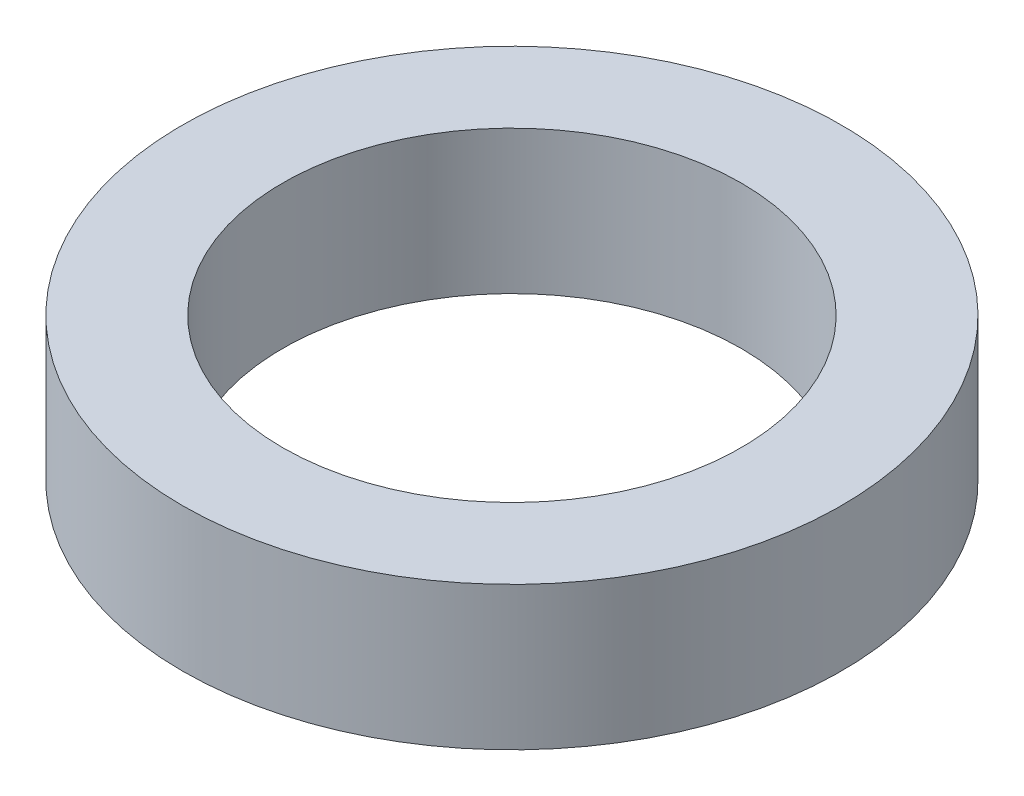
ISO-10303-21;
HEADER;
FILE_DESCRIPTION(('STEP AP214'),'2;1');
FILE_NAME('part.step','',(''),(''),'','','');
FILE_SCHEMA(('AUTOMOTIVE_DESIGN { 1 0 10303 214 1 1 1 1 }'));
ENDSEC;
DATA;
#1=APPLICATION_CONTEXT('core data for automotive mechanical design processes');
#2=APPLICATION_PROTOCOL_DEFINITION('international standard','automotive_design',2000,#1);
#3=PRODUCT_CONTEXT('',#1,'mechanical');
#4=PRODUCT('Part','Part','',(#3));
#5=PRODUCT_RELATED_PRODUCT_CATEGORY('part','',(#4));
#6=PRODUCT_DEFINITION_FORMATION('','',#4);
#7=PRODUCT_DEFINITION_CONTEXT('part definition',#1,'design');
#8=PRODUCT_DEFINITION('design','',#6,#7);
#9=PRODUCT_DEFINITION_SHAPE('','',#8);
#10=(LENGTH_UNIT() NAMED_UNIT(*) SI_UNIT(.MILLI.,.METRE.));
#11=(NAMED_UNIT(*) PLANE_ANGLE_UNIT() SI_UNIT($,.RADIAN.));
#12=(NAMED_UNIT(*) SI_UNIT($,.STERADIAN.) SOLID_ANGLE_UNIT());
#13=UNCERTAINTY_MEASURE_WITH_UNIT(LENGTH_MEASURE(1.E-05),#10,'distance_accuracy_value','');
#14=(GEOMETRIC_REPRESENTATION_CONTEXT(3) GLOBAL_UNCERTAINTY_ASSIGNED_CONTEXT((#13)) GLOBAL_UNIT_ASSIGNED_CONTEXT((#10,
#11,#12)) REPRESENTATION_CONTEXT('',''));
#15=CARTESIAN_POINT('',(0.,0.,0.));
#16=DIRECTION('',(0.,0.,1.));
#17=DIRECTION('',(1.,0.,0.));
#18=AXIS2_PLACEMENT_3D('',#15,#16,#17);
#19=CARTESIAN_POINT('',(0.,25.,0.));
#20=DIRECTION('',(0.,-1.,0.));
#21=DIRECTION('',(0.,0.,-1.));
#22=AXIS2_PLACEMENT_3D('',#19,#20,#21);
#23=CYLINDRICAL_SURFACE('',#22,57.5);
#24=CARTESIAN_POINT('',(0.,25.,0.));
#25=DIRECTION('',(0.,1.,0.));
#26=DIRECTION('',(0.,0.,1.));
#27=AXIS2_PLACEMENT_3D('',#24,#25,#26);
#28=CIRCLE('',#27,57.5);
#29=CARTESIAN_POINT('',(0.,25.,57.5));
#30=VERTEX_POINT('',#29);
#31=EDGE_CURVE('E10',#30,#30,#28,.T.);
#32=ORIENTED_EDGE('',*,*,#31,.F.);
#33=EDGE_LOOP('',(#32));
#34=FACE_BOUND('',#33,.T.);
#35=CARTESIAN_POINT('',(0.,0.,0.));
#36=DIRECTION('',(0.,1.,0.));
#37=DIRECTION('',(0.,0.,1.));
#38=AXIS2_PLACEMENT_3D('',#35,#36,#37);
#39=CIRCLE('',#38,57.5);
#40=CARTESIAN_POINT('',(0.,0.,57.5));
#41=VERTEX_POINT('',#40);
#42=EDGE_CURVE('E37',#41,#41,#39,.T.);
#43=ORIENTED_EDGE('',*,*,#42,.T.);
#44=EDGE_LOOP('',(#43));
#45=FACE_BOUND('',#44,.T.);
#46=ADVANCED_FACE('F40',(#34,#45),#23,.T.);
#47=CARTESIAN_POINT('',(0.,25.,0.));
#48=DIRECTION('',(0.,1.,0.));
#49=DIRECTION('',(0.,0.,1.));
#50=AXIS2_PLACEMENT_3D('',#47,#48,#49);
#51=PLANE('',#50);
#52=CARTESIAN_POINT('',(0.,25.,0.));
#53=DIRECTION('',(0.,1.,0.));
#54=DIRECTION('',(0.,0.,1.));
#55=AXIS2_PLACEMENT_3D('',#52,#53,#54);
#56=CIRCLE('',#55,40.);
#57=CARTESIAN_POINT('',(0.,25.,40.));
#58=VERTEX_POINT('',#57);
#59=EDGE_CURVE('E50',#58,#58,#56,.T.);
#60=ORIENTED_EDGE('',*,*,#59,.F.);
#61=EDGE_LOOP('',(#60));
#62=FACE_BOUND('',#61,.T.);
#63=ORIENTED_EDGE('',*,*,#31,.T.);
#64=EDGE_LOOP('',(#63));
#65=FACE_BOUND('',#64,.T.);
#66=ADVANCED_FACE('F59',(#62,#65),#51,.T.);
#67=CARTESIAN_POINT('',(0.,0.,0.));
#68=DIRECTION('',(0.,1.,0.));
#69=DIRECTION('',(0.,0.,1.));
#70=AXIS2_PLACEMENT_3D('',#67,#68,#69);
#71=PLANE('',#70);
#72=CARTESIAN_POINT('',(0.,0.,0.));
#73=DIRECTION('',(0.,1.,0.));
#74=DIRECTION('',(0.,0.,1.));
#75=AXIS2_PLACEMENT_3D('',#72,#73,#74);
#76=CIRCLE('',#75,40.);
#77=CARTESIAN_POINT('',(0.,0.,40.));
#78=VERTEX_POINT('',#77);
#79=EDGE_CURVE('E47',#78,#78,#76,.T.);
#80=ORIENTED_EDGE('',*,*,#79,.T.);
#81=EDGE_LOOP('',(#80));
#82=FACE_BOUND('',#81,.T.);
#83=ORIENTED_EDGE('',*,*,#42,.F.);
#84=EDGE_LOOP('',(#83));
#85=FACE_BOUND('',#84,.T.);
#86=ADVANCED_FACE('F58',(#82,#85),#71,.F.);
#87=CARTESIAN_POINT('',(0.,25.,0.));
#88=DIRECTION('',(0.,-1.,0.));
#89=DIRECTION('',(0.,0.,-1.));
#90=AXIS2_PLACEMENT_3D('',#87,#88,#89);
#91=CYLINDRICAL_SURFACE('',#90,40.);
#92=ORIENTED_EDGE('',*,*,#59,.T.);
#93=EDGE_LOOP('',(#92));
#94=FACE_BOUND('',#93,.T.);
#95=ORIENTED_EDGE('',*,*,#79,.F.);
#96=EDGE_LOOP('',(#95));
#97=FACE_BOUND('',#96,.T.);
#98=ADVANCED_FACE('F54',(#94,#97),#91,.F.);
#99=CLOSED_SHELL('',(#46,#66,#86,#98));
#100=MANIFOLD_SOLID_BREP('B2',#99);
#101=ADVANCED_BREP_SHAPE_REPRESENTATION('',(#18,#100),#14);
#102=SHAPE_DEFINITION_REPRESENTATION(#9,#101);
ENDSEC;
END-ISO-10303-21;
